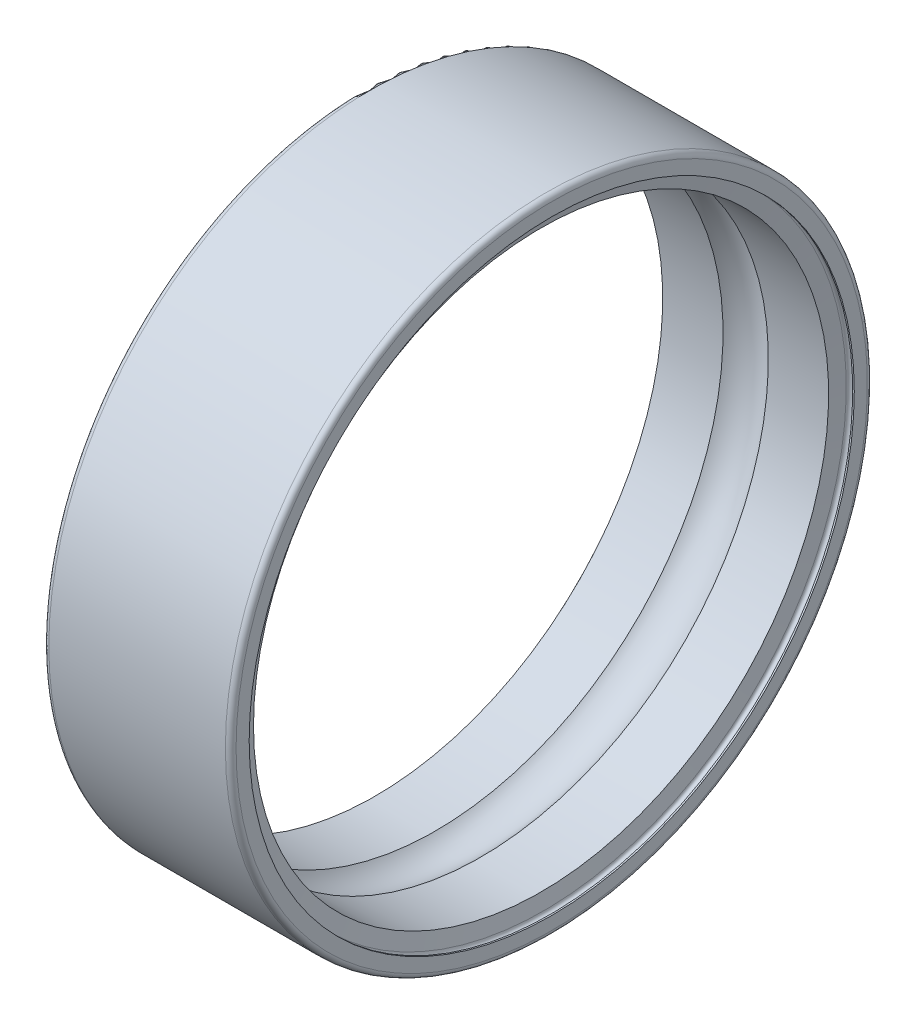
ISO-10303-21;
HEADER;
FILE_DESCRIPTION(('STEP AP214'),'2;1');
FILE_NAME('part.step','',(''),(''),'','','');
FILE_SCHEMA(('AUTOMOTIVE_DESIGN { 1 0 10303 214 1 1 1 1 }'));
ENDSEC;
DATA;
#1=APPLICATION_CONTEXT('core data for automotive mechanical design processes');
#2=APPLICATION_PROTOCOL_DEFINITION('international standard','automotive_design',2000,#1);
#3=PRODUCT_CONTEXT('',#1,'mechanical');
#4=PRODUCT('Part','Part','',(#3));
#5=PRODUCT_RELATED_PRODUCT_CATEGORY('part','',(#4));
#6=PRODUCT_DEFINITION_FORMATION('','',#4);
#7=PRODUCT_DEFINITION_CONTEXT('part definition',#1,'design');
#8=PRODUCT_DEFINITION('design','',#6,#7);
#9=PRODUCT_DEFINITION_SHAPE('','',#8);
#10=(LENGTH_UNIT() NAMED_UNIT(*) SI_UNIT(.MILLI.,.METRE.));
#11=(NAMED_UNIT(*) PLANE_ANGLE_UNIT() SI_UNIT($,.RADIAN.));
#12=(NAMED_UNIT(*) SI_UNIT($,.STERADIAN.) SOLID_ANGLE_UNIT());
#13=UNCERTAINTY_MEASURE_WITH_UNIT(LENGTH_MEASURE(1.E-05),#10,'distance_accuracy_value','');
#14=(GEOMETRIC_REPRESENTATION_CONTEXT(3) GLOBAL_UNCERTAINTY_ASSIGNED_CONTEXT((#13)) GLOBAL_UNIT_ASSIGNED_CONTEXT((#10,
#11,#12)) REPRESENTATION_CONTEXT('',''));
#15=CARTESIAN_POINT('',(0.,0.,0.));
#16=DIRECTION('',(0.,0.,1.));
#17=DIRECTION('',(1.,0.,0.));
#18=AXIS2_PLACEMENT_3D('',#15,#16,#17);
#19=CARTESIAN_POINT('',(0.,-6.06121135018697,-5.9));
#20=DIRECTION('',(-1.,0.,0.));
#21=DIRECTION('',(0.,0.,1.));
#22=AXIS2_PLACEMENT_3D('',#19,#20,#21);
#23=PLANE('',#22);
#24=CARTESIAN_POINT('',(0.,0.,0.));
#25=DIRECTION('',(-1.,0.,0.));
#26=DIRECTION('',(0.,0.,-1.));
#27=AXIS2_PLACEMENT_3D('',#24,#25,#26);
#28=CIRCLE('',#27,5.90000001010654);
#29=CARTESIAN_POINT('',(0.,0.,-5.90000001010654));
#30=VERTEX_POINT('',#29);
#31=EDGE_CURVE('E61',#30,#30,#28,.F.);
#32=ORIENTED_EDGE('',*,*,#31,.F.);
#33=EDGE_LOOP('',(#32));
#34=FACE_BOUND('',#33,.T.);
#35=CARTESIAN_POINT('',(0.,0.,0.));
#36=DIRECTION('',(1.,0.,0.));
#37=DIRECTION('',(0.,0.,1.));
#38=AXIS2_PLACEMENT_3D('',#35,#36,#37);
#39=CIRCLE('',#38,5.655);
#40=CARTESIAN_POINT('',(0.,0.,5.655));
#41=VERTEX_POINT('',#40);
#42=EDGE_CURVE('E58',#41,#41,#39,.T.);
#43=ORIENTED_EDGE('',*,*,#42,.T.);
#44=EDGE_LOOP('',(#43));
#45=FACE_BOUND('',#44,.T.);
#46=ADVANCED_FACE('F14',(#34,#45),#23,.T.);
#47=CARTESIAN_POINT('',(3.5,-6.06121135018697,5.9));
#48=DIRECTION('',(1.,0.,0.));
#49=DIRECTION('',(0.,0.,-1.));
#50=AXIS2_PLACEMENT_3D('',#47,#48,#49);
#51=PLANE('',#50);
#52=CARTESIAN_POINT('',(3.5,0.,0.));
#53=DIRECTION('',(1.,0.,0.));
#54=DIRECTION('',(0.,0.,1.));
#55=AXIS2_PLACEMENT_3D('',#52,#53,#54);
#56=CIRCLE('',#55,5.9);
#57=CARTESIAN_POINT('',(3.5,0.,5.9));
#58=VERTEX_POINT('',#57);
#59=EDGE_CURVE('E55',#58,#58,#56,.T.);
#60=ORIENTED_EDGE('',*,*,#59,.T.);
#61=EDGE_LOOP('',(#60));
#62=FACE_BOUND('',#61,.T.);
#63=CARTESIAN_POINT('',(3.5,0.,0.));
#64=DIRECTION('',(-1.,0.,0.));
#65=DIRECTION('',(0.,0.,-1.));
#66=AXIS2_PLACEMENT_3D('',#63,#64,#65);
#67=CIRCLE('',#66,5.655);
#68=CARTESIAN_POINT('',(3.5,0.,-5.655));
#69=VERTEX_POINT('',#68);
#70=EDGE_CURVE('E52',#69,#69,#67,.F.);
#71=ORIENTED_EDGE('',*,*,#70,.F.);
#72=EDGE_LOOP('',(#71));
#73=FACE_BOUND('',#72,.T.);
#74=ADVANCED_FACE('F70',(#62,#73),#51,.T.);
#75=CARTESIAN_POINT('',(0.0999999999999217,0.,0.));
#76=DIRECTION('',(1.,0.,0.));
#77=DIRECTION('',(0.,0.,1.));
#78=AXIS2_PLACEMENT_3D('',#75,#76,#77);
#79=TOROIDAL_SURFACE('',#78,5.90000000000008,0.0999999999999222);
#80=ORIENTED_EDGE('',*,*,#31,.T.);
#81=EDGE_LOOP('',(#80));
#82=FACE_BOUND('',#81,.T.);
#83=CARTESIAN_POINT('',(0.0999999999999217,0.,0.));
#84=DIRECTION('',(-1.,0.,0.));
#85=DIRECTION('',(0.,0.,-1.));
#86=AXIS2_PLACEMENT_3D('',#83,#84,#85);
#87=CIRCLE('',#86,6.);
#88=CARTESIAN_POINT('',(0.0999999999999217,0.,-6.));
#89=VERTEX_POINT('',#88);
#90=EDGE_CURVE('E49',#89,#89,#87,.F.);
#91=ORIENTED_EDGE('',*,*,#90,.F.);
#92=EDGE_LOOP('',(#91));
#93=FACE_BOUND('',#92,.T.);
#94=ADVANCED_FACE('F65',(#82,#93),#79,.T.);
#95=CARTESIAN_POINT('',(50.,0.,0.));
#96=DIRECTION('',(1.,0.,0.));
#97=DIRECTION('',(0.,0.,1.));
#98=AXIS2_PLACEMENT_3D('',#95,#96,#97);
#99=CYLINDRICAL_SURFACE('',#98,5.655);
#100=CARTESIAN_POINT('',(0.0300000000000011,0.,0.));
#101=DIRECTION('',(1.,0.,0.));
#102=DIRECTION('',(0.,0.,1.));
#103=AXIS2_PLACEMENT_3D('',#100,#101,#102);
#104=CIRCLE('',#103,5.655);
#105=CARTESIAN_POINT('',(0.0300000000000011,0.,5.655));
#106=VERTEX_POINT('',#105);
#107=EDGE_CURVE('E46',#106,#106,#104,.T.);
#108=ORIENTED_EDGE('',*,*,#107,.T.);
#109=EDGE_LOOP('',(#108));
#110=FACE_BOUND('',#109,.T.);
#111=ORIENTED_EDGE('',*,*,#42,.F.);
#112=EDGE_LOOP('',(#111));
#113=FACE_BOUND('',#112,.T.);
#114=ADVANCED_FACE('F74',(#110,#113),#99,.F.);
#115=CARTESIAN_POINT('',(0.09,0.,0.));
#116=DIRECTION('',(1.,0.,0.));
#117=DIRECTION('',(0.,0.,1.));
#118=AXIS2_PLACEMENT_3D('',#115,#116,#117);
#119=TOROIDAL_SURFACE('',#118,5.655,0.06);
#120=ORIENTED_EDGE('',*,*,#107,.F.);
#121=EDGE_LOOP('',(#120));
#122=FACE_BOUND('',#121,.T.);
#123=CARTESIAN_POINT('',(0.15,0.,0.));
#124=DIRECTION('',(1.,0.,0.));
#125=DIRECTION('',(0.,0.,1.));
#126=AXIS2_PLACEMENT_3D('',#123,#124,#125);
#127=CIRCLE('',#126,5.655);
#128=CARTESIAN_POINT('',(0.15,0.,5.655));
#129=VERTEX_POINT('',#128);
#130=EDGE_CURVE('E43',#129,#129,#127,.T.);
#131=ORIENTED_EDGE('',*,*,#130,.T.);
#132=EDGE_LOOP('',(#131));
#133=FACE_BOUND('',#132,.T.);
#134=ADVANCED_FACE('F76',(#122,#133),#119,.F.);
#135=CARTESIAN_POINT('',(0.149999999999997,0.,0.));
#136=DIRECTION('',(-1.,0.,0.));
#137=DIRECTION('',(0.,0.,-1.));
#138=AXIS2_PLACEMENT_3D('',#135,#136,#137);
#139=CONICAL_SURFACE('',#138,5.655,1.39626340159545);
#140=ORIENTED_EDGE('',*,*,#130,.F.);
#141=EDGE_LOOP('',(#140));
#142=FACE_BOUND('',#141,.T.);
#143=CARTESIAN_POINT('',(0.199371554598371,0.,0.));
#144=DIRECTION('',(1.,0.,0.));
#145=DIRECTION('',(0.,0.,1.));
#146=AXIS2_PLACEMENT_3D('',#143,#144,#145);
#147=CIRCLE('',#146,5.375);
#148=CARTESIAN_POINT('',(0.199371554598371,0.,5.375));
#149=VERTEX_POINT('',#148);
#150=EDGE_CURVE('E40',#149,#149,#147,.T.);
#151=ORIENTED_EDGE('',*,*,#150,.T.);
#152=EDGE_LOOP('',(#151));
#153=FACE_BOUND('',#152,.T.);
#154=ADVANCED_FACE('F84',(#142,#153),#139,.F.);
#155=CARTESIAN_POINT('',(50.,0.,0.));
#156=DIRECTION('',(1.,0.,0.));
#157=DIRECTION('',(0.,0.,1.));
#158=AXIS2_PLACEMENT_3D('',#155,#156,#157);
#159=CYLINDRICAL_SURFACE('',#158,5.375);
#160=CARTESIAN_POINT('',(1.3264731413476,0.,0.));
#161=DIRECTION('',(1.,0.,0.));
#162=DIRECTION('',(0.,0.,1.));
#163=AXIS2_PLACEMENT_3D('',#160,#161,#162);
#164=CIRCLE('',#163,5.375);
#165=CARTESIAN_POINT('',(1.3264731413476,0.,5.375));
#166=VERTEX_POINT('',#165);
#167=EDGE_CURVE('E37',#166,#166,#164,.T.);
#168=ORIENTED_EDGE('',*,*,#167,.T.);
#169=EDGE_LOOP('',(#168));
#170=FACE_BOUND('',#169,.T.);
#171=ORIENTED_EDGE('',*,*,#150,.F.);
#172=EDGE_LOOP('',(#171));
#173=FACE_BOUND('',#172,.T.);
#174=ADVANCED_FACE('F92',(#170,#173),#159,.F.);
#175=CARTESIAN_POINT('',(1.75,0.,0.));
#176=DIRECTION('',(1.,0.,0.));
#177=DIRECTION('',(0.,0.,1.));
#178=AXIS2_PLACEMENT_3D('',#175,#176,#177);
#179=TOROIDAL_SURFACE('',#178,4.95000000000009,0.599999999999915);
#180=ORIENTED_EDGE('',*,*,#167,.F.);
#181=EDGE_LOOP('',(#180));
#182=FACE_BOUND('',#181,.T.);
#183=CARTESIAN_POINT('',(2.1735268586524,0.,0.));
#184=DIRECTION('',(1.,0.,0.));
#185=DIRECTION('',(0.,0.,1.));
#186=AXIS2_PLACEMENT_3D('',#183,#184,#185);
#187=CIRCLE('',#186,5.375);
#188=CARTESIAN_POINT('',(2.1735268586524,0.,5.375));
#189=VERTEX_POINT('',#188);
#190=EDGE_CURVE('E34',#189,#189,#187,.T.);
#191=ORIENTED_EDGE('',*,*,#190,.T.);
#192=EDGE_LOOP('',(#191));
#193=FACE_BOUND('',#192,.T.);
#194=ADVANCED_FACE('F96',(#182,#193),#179,.F.);
#195=CARTESIAN_POINT('',(50.,0.,0.));
#196=DIRECTION('',(1.,0.,0.));
#197=DIRECTION('',(0.,0.,1.));
#198=AXIS2_PLACEMENT_3D('',#195,#196,#197);
#199=CYLINDRICAL_SURFACE('',#198,5.375);
#200=CARTESIAN_POINT('',(3.3006284454016,0.,0.));
#201=DIRECTION('',(1.,0.,0.));
#202=DIRECTION('',(0.,0.,1.));
#203=AXIS2_PLACEMENT_3D('',#200,#201,#202);
#204=CIRCLE('',#203,5.375);
#205=CARTESIAN_POINT('',(3.3006284454016,0.,5.375));
#206=VERTEX_POINT('',#205);
#207=EDGE_CURVE('E29',#206,#206,#204,.T.);
#208=ORIENTED_EDGE('',*,*,#207,.T.);
#209=EDGE_LOOP('',(#208));
#210=FACE_BOUND('',#209,.T.);
#211=ORIENTED_EDGE('',*,*,#190,.F.);
#212=EDGE_LOOP('',(#211));
#213=FACE_BOUND('',#212,.T.);
#214=ADVANCED_FACE('F100',(#210,#213),#199,.F.);
#215=CARTESIAN_POINT('',(3.35,0.,0.));
#216=DIRECTION('',(1.,0.,0.));
#217=DIRECTION('',(0.,0.,1.));
#218=AXIS2_PLACEMENT_3D('',#215,#216,#217);
#219=CONICAL_SURFACE('',#218,5.655,1.39626340159536);
#220=CARTESIAN_POINT('',(3.35,0.,0.));
#221=DIRECTION('',(1.,0.,0.));
#222=DIRECTION('',(0.,0.,1.));
#223=AXIS2_PLACEMENT_3D('',#220,#221,#222);
#224=CIRCLE('',#223,5.655);
#225=CARTESIAN_POINT('',(3.35,0.,5.655));
#226=VERTEX_POINT('',#225);
#227=EDGE_CURVE('E25',#226,#226,#224,.T.);
#228=ORIENTED_EDGE('',*,*,#227,.T.);
#229=EDGE_LOOP('',(#228));
#230=FACE_BOUND('',#229,.T.);
#231=ORIENTED_EDGE('',*,*,#207,.F.);
#232=EDGE_LOOP('',(#231));
#233=FACE_BOUND('',#232,.T.);
#234=ADVANCED_FACE('F104',(#230,#233),#219,.F.);
#235=CARTESIAN_POINT('',(3.41,0.,0.));
#236=DIRECTION('',(1.,0.,0.));
#237=DIRECTION('',(0.,0.,1.));
#238=AXIS2_PLACEMENT_3D('',#235,#236,#237);
#239=TOROIDAL_SURFACE('',#238,5.655,0.06);
#240=ORIENTED_EDGE('',*,*,#227,.F.);
#241=EDGE_LOOP('',(#240));
#242=FACE_BOUND('',#241,.T.);
#243=CARTESIAN_POINT('',(3.47,0.,0.));
#244=DIRECTION('',(1.,0.,0.));
#245=DIRECTION('',(0.,0.,1.));
#246=AXIS2_PLACEMENT_3D('',#243,#244,#245);
#247=CIRCLE('',#246,5.655);
#248=CARTESIAN_POINT('',(3.47,0.,5.655));
#249=VERTEX_POINT('',#248);
#250=EDGE_CURVE('E21',#249,#249,#247,.T.);
#251=ORIENTED_EDGE('',*,*,#250,.T.);
#252=EDGE_LOOP('',(#251));
#253=FACE_BOUND('',#252,.T.);
#254=ADVANCED_FACE('F108',(#242,#253),#239,.F.);
#255=CARTESIAN_POINT('',(50.,0.,0.));
#256=DIRECTION('',(1.,0.,0.));
#257=DIRECTION('',(0.,1.1683810700118E-09,1.));
#258=AXIS2_PLACEMENT_3D('',#255,#256,#257);
#259=CYLINDRICAL_SURFACE('',#258,5.655);
#260=ORIENTED_EDGE('',*,*,#70,.T.);
#261=EDGE_LOOP('',(#260));
#262=FACE_BOUND('',#261,.T.);
#263=ORIENTED_EDGE('',*,*,#250,.F.);
#264=EDGE_LOOP('',(#263));
#265=FACE_BOUND('',#264,.T.);
#266=ADVANCED_FACE('F112',(#262,#265),#259,.F.);
#267=CARTESIAN_POINT('',(3.40000000000015,0.,0.));
#268=DIRECTION('',(1.,0.,0.));
#269=DIRECTION('',(0.,0.,1.));
#270=AXIS2_PLACEMENT_3D('',#267,#268,#269);
#271=TOROIDAL_SURFACE('',#270,5.90000000000016,0.099999999999845);
#272=CARTESIAN_POINT('',(3.40000000000015,0.,0.));
#273=DIRECTION('',(1.,0.,0.));
#274=DIRECTION('',(0.,0.,1.));
#275=AXIS2_PLACEMENT_3D('',#272,#273,#274);
#276=CIRCLE('',#275,6.00000000000001);
#277=CARTESIAN_POINT('',(3.40000000000015,0.,6.00000000000001));
#278=VERTEX_POINT('',#277);
#279=EDGE_CURVE('E10',#278,#278,#276,.T.);
#280=ORIENTED_EDGE('',*,*,#279,.T.);
#281=EDGE_LOOP('',(#280));
#282=FACE_BOUND('',#281,.T.);
#283=ORIENTED_EDGE('',*,*,#59,.F.);
#284=EDGE_LOOP('',(#283));
#285=FACE_BOUND('',#284,.T.);
#286=ADVANCED_FACE('F115',(#282,#285),#271,.T.);
#287=CARTESIAN_POINT('',(50.,0.,0.));
#288=DIRECTION('',(1.,0.,0.));
#289=DIRECTION('',(0.,0.,1.));
#290=AXIS2_PLACEMENT_3D('',#287,#288,#289);
#291=CYLINDRICAL_SURFACE('',#290,6.);
#292=ORIENTED_EDGE('',*,*,#90,.T.);
#293=EDGE_LOOP('',(#292));
#294=FACE_BOUND('',#293,.T.);
#295=ORIENTED_EDGE('',*,*,#279,.F.);
#296=EDGE_LOOP('',(#295));
#297=FACE_BOUND('',#296,.T.);
#298=ADVANCED_FACE('F16',(#294,#297),#291,.T.);
#299=CLOSED_SHELL('',(#46,#74,#94,#114,#134,#154,#174,#194,#214,#234,#254,#266,#286,#298));
#300=MANIFOLD_SOLID_BREP('B1',#299);
#301=ADVANCED_BREP_SHAPE_REPRESENTATION('',(#18,#300),#14);
#302=SHAPE_DEFINITION_REPRESENTATION(#9,#301);
ENDSEC;
END-ISO-10303-21;
